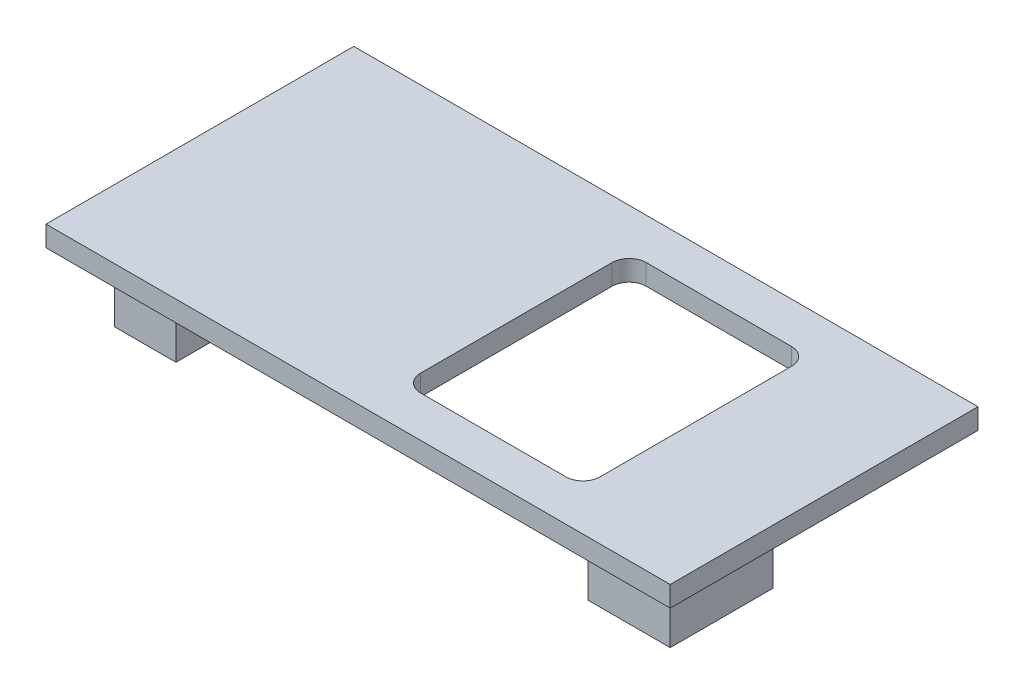
ISO-10303-21;
HEADER;
FILE_DESCRIPTION(('STEP AP214'),'2;1');
FILE_NAME('part.step','',(''),(''),'','','');
FILE_SCHEMA(('AUTOMOTIVE_DESIGN { 1 0 10303 214 1 1 1 1 }'));
ENDSEC;
DATA;
#1=APPLICATION_CONTEXT('core data for automotive mechanical design processes');
#2=APPLICATION_PROTOCOL_DEFINITION('international standard','automotive_design',2000,#1);
#3=PRODUCT_CONTEXT('',#1,'mechanical');
#4=PRODUCT('Part','Part','',(#3));
#5=PRODUCT_RELATED_PRODUCT_CATEGORY('part','',(#4));
#6=PRODUCT_DEFINITION_FORMATION('','',#4);
#7=PRODUCT_DEFINITION_CONTEXT('part definition',#1,'design');
#8=PRODUCT_DEFINITION('design','',#6,#7);
#9=PRODUCT_DEFINITION_SHAPE('','',#8);
#10=(LENGTH_UNIT() NAMED_UNIT(*) SI_UNIT(.MILLI.,.METRE.));
#11=(NAMED_UNIT(*) PLANE_ANGLE_UNIT() SI_UNIT($,.RADIAN.));
#12=(NAMED_UNIT(*) SI_UNIT($,.STERADIAN.) SOLID_ANGLE_UNIT());
#13=UNCERTAINTY_MEASURE_WITH_UNIT(LENGTH_MEASURE(1.E-05),#10,'distance_accuracy_value','');
#14=(GEOMETRIC_REPRESENTATION_CONTEXT(3) GLOBAL_UNCERTAINTY_ASSIGNED_CONTEXT((#13)) GLOBAL_UNIT_ASSIGNED_CONTEXT((#10,
#11,#12)) REPRESENTATION_CONTEXT('',''));
#15=CARTESIAN_POINT('',(0.,0.,0.));
#16=DIRECTION('',(0.,0.,1.));
#17=DIRECTION('',(1.,0.,0.));
#18=AXIS2_PLACEMENT_3D('',#15,#16,#17);
#19=CARTESIAN_POINT('',(0.,0.,0.));
#20=DIRECTION('',(0.,-1.,0.));
#21=DIRECTION('',(0.,0.,-1.));
#22=AXIS2_PLACEMENT_3D('',#19,#20,#21);
#23=PLANE('',#22);
#24=DIRECTION('',(-1.,0.,0.));
#25=VECTOR('',#24,1.);
#26=CARTESIAN_POINT('',(18.5,0.,-15.6));
#27=LINE('',#26,#25);
#28=CARTESIAN_POINT('',(28.,0.,-15.6));
#29=VERTEX_POINT('',#28);
#30=CARTESIAN_POINT('',(19.5,0.,-15.6));
#31=VERTEX_POINT('',#30);
#32=EDGE_CURVE('E377',#29,#31,#27,.T.);
#33=ORIENTED_EDGE('',*,*,#32,.T.);
#34=CARTESIAN_POINT('',(19.5,0.,-14.6));
#35=DIRECTION('',(0.,-1.,0.));
#36=DIRECTION('',(0.,0.,-1.));
#37=AXIS2_PLACEMENT_3D('',#34,#35,#36);
#38=CIRCLE('',#37,1.);
#39=CARTESIAN_POINT('',(18.5,0.,-14.6));
#40=VERTEX_POINT('',#39);
#41=EDGE_CURVE('E11',#31,#40,#38,.F.);
#42=ORIENTED_EDGE('',*,*,#41,.T.);
#43=DIRECTION('',(0.,0.,1.));
#44=VECTOR('',#43,1.);
#45=CARTESIAN_POINT('',(18.5,0.,-15.6));
#46=LINE('',#45,#44);
#47=CARTESIAN_POINT('',(18.5,0.,-3.4));
#48=VERTEX_POINT('',#47);
#49=EDGE_CURVE('E375',#40,#48,#46,.T.);
#50=ORIENTED_EDGE('',*,*,#49,.T.);
#51=CARTESIAN_POINT('',(19.5,0.,-3.4));
#52=DIRECTION('',(0.,-1.,0.));
#53=DIRECTION('',(0.,0.,-1.));
#54=AXIS2_PLACEMENT_3D('',#51,#52,#53);
#55=CIRCLE('',#54,1.);
#56=CARTESIAN_POINT('',(19.5,0.,-2.4));
#57=VERTEX_POINT('',#56);
#58=EDGE_CURVE('E340',#48,#57,#55,.F.);
#59=ORIENTED_EDGE('',*,*,#58,.T.);
#60=DIRECTION('',(1.,0.,0.));
#61=VECTOR('',#60,1.);
#62=CARTESIAN_POINT('',(18.5,0.,-2.4));
#63=LINE('',#62,#61);
#64=CARTESIAN_POINT('',(28.,0.,-2.4));
#65=VERTEX_POINT('',#64);
#66=EDGE_CURVE('E368',#57,#65,#63,.T.);
#67=ORIENTED_EDGE('',*,*,#66,.T.);
#68=CARTESIAN_POINT('',(28.,0.,-3.4));
#69=DIRECTION('',(0.,-1.,0.));
#70=DIRECTION('',(0.,0.,-1.));
#71=AXIS2_PLACEMENT_3D('',#68,#69,#70);
#72=CIRCLE('',#71,1.);
#73=CARTESIAN_POINT('',(29.,0.,-3.4));
#74=VERTEX_POINT('',#73);
#75=EDGE_CURVE('E346',#65,#74,#72,.F.);
#76=ORIENTED_EDGE('',*,*,#75,.T.);
#77=DIRECTION('',(0.,0.,-1.));
#78=VECTOR('',#77,1.);
#79=CARTESIAN_POINT('',(29.,0.,-15.6));
#80=LINE('',#79,#78);
#81=CARTESIAN_POINT('',(29.,0.,-14.6));
#82=VERTEX_POINT('',#81);
#83=EDGE_CURVE('E387',#74,#82,#80,.T.);
#84=ORIENTED_EDGE('',*,*,#83,.T.);
#85=CARTESIAN_POINT('',(28.,0.,-14.6));
#86=DIRECTION('',(0.,-1.,0.));
#87=DIRECTION('',(0.,0.,-1.));
#88=AXIS2_PLACEMENT_3D('',#85,#86,#87);
#89=CIRCLE('',#88,1.);
#90=EDGE_CURVE('E68',#82,#29,#89,.F.);
#91=ORIENTED_EDGE('',*,*,#90,.T.);
#92=EDGE_LOOP('',(#33,#42,#50,#59,#67,#76,#84,#91));
#93=FACE_BOUND('',#92,.T.);
#94=DIRECTION('',(0.,0.,1.));
#95=VECTOR('',#94,1.);
#96=CARTESIAN_POINT('',(0.,0.,0.));
#97=LINE('',#96,#95);
#98=CARTESIAN_POINT('',(0.,0.,-18.));
#99=VERTEX_POINT('',#98);
#100=CARTESIAN_POINT('',(0.,0.,0.));
#101=VERTEX_POINT('',#100);
#102=EDGE_CURVE('E268',#99,#101,#97,.T.);
#103=ORIENTED_EDGE('',*,*,#102,.F.);
#104=DIRECTION('',(-1.,0.,0.));
#105=VECTOR('',#104,1.);
#106=CARTESIAN_POINT('',(0.,0.,-18.));
#107=LINE('',#106,#105);
#108=CARTESIAN_POINT('',(36.5,0.,-18.));
#109=VERTEX_POINT('',#108);
#110=EDGE_CURVE('E274',#109,#99,#107,.T.);
#111=ORIENTED_EDGE('',*,*,#110,.F.);
#112=DIRECTION('',(0.,0.,-1.));
#113=VECTOR('',#112,1.);
#114=CARTESIAN_POINT('',(36.5,0.,0.));
#115=LINE('',#114,#113);
#116=CARTESIAN_POINT('',(36.5,0.,0.));
#117=VERTEX_POINT('',#116);
#118=EDGE_CURVE('E290',#117,#109,#115,.T.);
#119=ORIENTED_EDGE('',*,*,#118,.F.);
#120=DIRECTION('',(1.,0.,0.));
#121=VECTOR('',#120,1.);
#122=CARTESIAN_POINT('',(0.,0.,0.));
#123=LINE('',#122,#121);
#124=EDGE_CURVE('E287',#101,#117,#123,.T.);
#125=ORIENTED_EDGE('',*,*,#124,.F.);
#126=EDGE_LOOP('',(#103,#111,#119,#125));
#127=FACE_BOUND('',#126,.T.);
#128=DIRECTION('',(1.,0.,0.));
#129=VECTOR('',#128,1.);
#130=CARTESIAN_POINT('',(2.,0.,-7.));
#131=LINE('',#130,#129);
#132=CARTESIAN_POINT('',(2.,0.,-7.));
#133=VERTEX_POINT('',#132);
#134=CARTESIAN_POINT('',(5.6,0.,-7.));
#135=VERTEX_POINT('',#134);
#136=EDGE_CURVE('E217',#133,#135,#131,.T.);
#137=ORIENTED_EDGE('',*,*,#136,.F.);
#138=DIRECTION('',(0.,0.,-1.));
#139=VECTOR('',#138,1.);
#140=CARTESIAN_POINT('',(2.,0.,-2.));
#141=LINE('',#140,#139);
#142=CARTESIAN_POINT('',(2.,0.,-2.));
#143=VERTEX_POINT('',#142);
#144=EDGE_CURVE('E212',#143,#133,#141,.T.);
#145=ORIENTED_EDGE('',*,*,#144,.F.);
#146=DIRECTION('',(-1.,0.,0.));
#147=VECTOR('',#146,1.);
#148=CARTESIAN_POINT('',(2.,0.,-2.));
#149=LINE('',#148,#147);
#150=CARTESIAN_POINT('',(5.6,0.,-2.));
#151=VERTEX_POINT('',#150);
#152=EDGE_CURVE('E237',#151,#143,#149,.T.);
#153=ORIENTED_EDGE('',*,*,#152,.F.);
#154=DIRECTION('',(0.,0.,1.));
#155=VECTOR('',#154,1.);
#156=CARTESIAN_POINT('',(5.6,0.,-2.));
#157=LINE('',#156,#155);
#158=EDGE_CURVE('E249',#135,#151,#157,.T.);
#159=ORIENTED_EDGE('',*,*,#158,.F.);
#160=EDGE_LOOP('',(#137,#145,#153,#159));
#161=FACE_BOUND('',#160,.T.);
#162=DIRECTION('',(-1.,0.,0.));
#163=VECTOR('',#162,1.);
#164=CARTESIAN_POINT('',(34.5,0.,-2.));
#165=LINE('',#164,#163);
#166=CARTESIAN_POINT('',(34.5,0.,-2.));
#167=VERTEX_POINT('',#166);
#168=CARTESIAN_POINT('',(29.7,0.,-2.));
#169=VERTEX_POINT('',#168);
#170=EDGE_CURVE('E210',#167,#169,#165,.T.);
#171=ORIENTED_EDGE('',*,*,#170,.F.);
#172=DIRECTION('',(0.,0.,1.));
#173=VECTOR('',#172,1.);
#174=CARTESIAN_POINT('',(34.5,0.,-2.));
#175=LINE('',#174,#173);
#176=CARTESIAN_POINT('',(34.5,0.,-8.));
#177=VERTEX_POINT('',#176);
#178=EDGE_CURVE('E204',#177,#167,#175,.T.);
#179=ORIENTED_EDGE('',*,*,#178,.F.);
#180=DIRECTION('',(1.,0.,0.));
#181=VECTOR('',#180,1.);
#182=CARTESIAN_POINT('',(34.5,0.,-8.));
#183=LINE('',#182,#181);
#184=CARTESIAN_POINT('',(29.7,0.,-8.));
#185=VERTEX_POINT('',#184);
#186=EDGE_CURVE('E184',#185,#177,#183,.T.);
#187=ORIENTED_EDGE('',*,*,#186,.F.);
#188=DIRECTION('',(0.,0.,-1.));
#189=VECTOR('',#188,1.);
#190=CARTESIAN_POINT('',(29.7,0.,-2.));
#191=LINE('',#190,#189);
#192=EDGE_CURVE('E197',#169,#185,#191,.T.);
#193=ORIENTED_EDGE('',*,*,#192,.F.);
#194=EDGE_LOOP('',(#171,#179,#187,#193));
#195=FACE_BOUND('',#194,.T.);
#196=ADVANCED_FACE('F45',(#93,#127,#161,#195),#23,.T.);
#197=CARTESIAN_POINT('',(0.,1.2,0.));
#198=DIRECTION('',(1.,0.,0.));
#199=DIRECTION('',(0.,0.,-1.));
#200=AXIS2_PLACEMENT_3D('',#197,#198,#199);
#201=PLANE('',#200);
#202=ORIENTED_EDGE('',*,*,#102,.T.);
#203=DIRECTION('',(0.,-1.,0.));
#204=VECTOR('',#203,1.);
#205=CARTESIAN_POINT('',(0.,1.2,0.));
#206=LINE('',#205,#204);
#207=CARTESIAN_POINT('',(0.,1.2,0.));
#208=VERTEX_POINT('',#207);
#209=EDGE_CURVE('E306',#208,#101,#206,.T.);
#210=ORIENTED_EDGE('',*,*,#209,.F.);
#211=DIRECTION('',(0.,0.,1.));
#212=VECTOR('',#211,1.);
#213=CARTESIAN_POINT('',(0.,1.2,0.));
#214=LINE('',#213,#212);
#215=CARTESIAN_POINT('',(0.,1.2,-18.));
#216=VERTEX_POINT('',#215);
#217=EDGE_CURVE('E269',#216,#208,#214,.T.);
#218=ORIENTED_EDGE('',*,*,#217,.F.);
#219=DIRECTION('',(0.,-1.,0.));
#220=VECTOR('',#219,1.);
#221=CARTESIAN_POINT('',(0.,1.2,-18.));
#222=LINE('',#221,#220);
#223=EDGE_CURVE('E283',#216,#99,#222,.T.);
#224=ORIENTED_EDGE('',*,*,#223,.T.);
#225=EDGE_LOOP('',(#202,#210,#218,#224));
#226=FACE_BOUND('',#225,.T.);
#227=ADVANCED_FACE('F427',(#226),#201,.F.);
#228=CARTESIAN_POINT('',(0.,1.2,0.));
#229=DIRECTION('',(0.,0.,-1.));
#230=DIRECTION('',(-1.,0.,0.));
#231=AXIS2_PLACEMENT_3D('',#228,#229,#230);
#232=PLANE('',#231);
#233=ORIENTED_EDGE('',*,*,#124,.T.);
#234=DIRECTION('',(0.,-1.,0.));
#235=VECTOR('',#234,1.);
#236=CARTESIAN_POINT('',(36.5,1.2,0.));
#237=LINE('',#236,#235);
#238=CARTESIAN_POINT('',(36.5,1.2,0.));
#239=VERTEX_POINT('',#238);
#240=EDGE_CURVE('E302',#239,#117,#237,.T.);
#241=ORIENTED_EDGE('',*,*,#240,.F.);
#242=DIRECTION('',(1.,0.,0.));
#243=VECTOR('',#242,1.);
#244=CARTESIAN_POINT('',(0.,1.2,0.));
#245=LINE('',#244,#243);
#246=EDGE_CURVE('E273',#208,#239,#245,.T.);
#247=ORIENTED_EDGE('',*,*,#246,.F.);
#248=ORIENTED_EDGE('',*,*,#209,.T.);
#249=EDGE_LOOP('',(#233,#241,#247,#248));
#250=FACE_BOUND('',#249,.T.);
#251=ADVANCED_FACE('F433',(#250),#232,.F.);
#252=CARTESIAN_POINT('',(36.5,1.2,0.));
#253=DIRECTION('',(-1.,0.,0.));
#254=DIRECTION('',(0.,0.,1.));
#255=AXIS2_PLACEMENT_3D('',#252,#253,#254);
#256=PLANE('',#255);
#257=ORIENTED_EDGE('',*,*,#118,.T.);
#258=DIRECTION('',(0.,-1.,0.));
#259=VECTOR('',#258,1.);
#260=CARTESIAN_POINT('',(36.5,1.2,-18.));
#261=LINE('',#260,#259);
#262=CARTESIAN_POINT('',(36.5,1.2,-18.));
#263=VERTEX_POINT('',#262);
#264=EDGE_CURVE('E298',#263,#109,#261,.T.);
#265=ORIENTED_EDGE('',*,*,#264,.F.);
#266=DIRECTION('',(0.,0.,-1.));
#267=VECTOR('',#266,1.);
#268=CARTESIAN_POINT('',(36.5,1.2,0.));
#269=LINE('',#268,#267);
#270=EDGE_CURVE('E277',#239,#263,#269,.T.);
#271=ORIENTED_EDGE('',*,*,#270,.F.);
#272=ORIENTED_EDGE('',*,*,#240,.T.);
#273=EDGE_LOOP('',(#257,#265,#271,#272));
#274=FACE_BOUND('',#273,.T.);
#275=ADVANCED_FACE('F442',(#274),#256,.F.);
#276=CARTESIAN_POINT('',(0.,1.2,-18.));
#277=DIRECTION('',(0.,0.,1.));
#278=DIRECTION('',(1.,0.,0.));
#279=AXIS2_PLACEMENT_3D('',#276,#277,#278);
#280=PLANE('',#279);
#281=ORIENTED_EDGE('',*,*,#110,.T.);
#282=ORIENTED_EDGE('',*,*,#223,.F.);
#283=DIRECTION('',(-1.,0.,0.));
#284=VECTOR('',#283,1.);
#285=CARTESIAN_POINT('',(0.,1.2,-18.));
#286=LINE('',#285,#284);
#287=EDGE_CURVE('E280',#263,#216,#286,.T.);
#288=ORIENTED_EDGE('',*,*,#287,.F.);
#289=ORIENTED_EDGE('',*,*,#264,.T.);
#290=EDGE_LOOP('',(#281,#282,#288,#289));
#291=FACE_BOUND('',#290,.T.);
#292=ADVANCED_FACE('F439',(#291),#280,.F.);
#293=CARTESIAN_POINT('',(0.,1.2,0.));
#294=DIRECTION('',(0.,-1.,0.));
#295=DIRECTION('',(0.,0.,-1.));
#296=AXIS2_PLACEMENT_3D('',#293,#294,#295);
#297=PLANE('',#296);
#298=DIRECTION('',(1.,0.,0.));
#299=VECTOR('',#298,1.);
#300=CARTESIAN_POINT('',(18.5,1.2,-2.4));
#301=LINE('',#300,#299);
#302=CARTESIAN_POINT('',(19.5,1.2,-2.4));
#303=VERTEX_POINT('',#302);
#304=CARTESIAN_POINT('',(28.,1.2,-2.4));
#305=VERTEX_POINT('',#304);
#306=EDGE_CURVE('E385',#303,#305,#301,.T.);
#307=ORIENTED_EDGE('',*,*,#306,.F.);
#308=CARTESIAN_POINT('',(19.5,1.2,-3.4));
#309=DIRECTION('',(0.,-1.,0.));
#310=DIRECTION('',(0.,0.,-1.));
#311=AXIS2_PLACEMENT_3D('',#308,#309,#310);
#312=CIRCLE('',#311,1.);
#313=CARTESIAN_POINT('',(18.5,1.2,-3.4));
#314=VERTEX_POINT('',#313);
#315=EDGE_CURVE('E337',#303,#314,#312,.T.);
#316=ORIENTED_EDGE('',*,*,#315,.T.);
#317=DIRECTION('',(0.,0.,1.));
#318=VECTOR('',#317,1.);
#319=CARTESIAN_POINT('',(18.5,1.2,-15.6));
#320=LINE('',#319,#318);
#321=CARTESIAN_POINT('',(18.5,1.2,-14.6));
#322=VERTEX_POINT('',#321);
#323=EDGE_CURVE('E362',#322,#314,#320,.T.);
#324=ORIENTED_EDGE('',*,*,#323,.F.);
#325=CARTESIAN_POINT('',(19.5,1.2,-14.6));
#326=DIRECTION('',(0.,-1.,0.));
#327=DIRECTION('',(0.,0.,-1.));
#328=AXIS2_PLACEMENT_3D('',#325,#326,#327);
#329=CIRCLE('',#328,1.);
#330=CARTESIAN_POINT('',(19.5,1.2,-15.6));
#331=VERTEX_POINT('',#330);
#332=EDGE_CURVE('E54',#322,#331,#329,.T.);
#333=ORIENTED_EDGE('',*,*,#332,.T.);
#334=DIRECTION('',(-1.,0.,0.));
#335=VECTOR('',#334,1.);
#336=CARTESIAN_POINT('',(18.5,1.2,-15.6));
#337=LINE('',#336,#335);
#338=CARTESIAN_POINT('',(28.,1.2,-15.6));
#339=VERTEX_POINT('',#338);
#340=EDGE_CURVE('E360',#339,#331,#337,.T.);
#341=ORIENTED_EDGE('',*,*,#340,.F.);
#342=CARTESIAN_POINT('',(28.,1.2,-14.6));
#343=DIRECTION('',(0.,-1.,0.));
#344=DIRECTION('',(0.,0.,-1.));
#345=AXIS2_PLACEMENT_3D('',#342,#343,#344);
#346=CIRCLE('',#345,1.);
#347=CARTESIAN_POINT('',(29.,1.2,-14.6));
#348=VERTEX_POINT('',#347);
#349=EDGE_CURVE('E349',#339,#348,#346,.T.);
#350=ORIENTED_EDGE('',*,*,#349,.T.);
#351=DIRECTION('',(0.,0.,-1.));
#352=VECTOR('',#351,1.);
#353=CARTESIAN_POINT('',(29.,1.2,-15.6));
#354=LINE('',#353,#352);
#355=CARTESIAN_POINT('',(29.,1.2,-3.4));
#356=VERTEX_POINT('',#355);
#357=EDGE_CURVE('E369',#356,#348,#354,.T.);
#358=ORIENTED_EDGE('',*,*,#357,.F.);
#359=CARTESIAN_POINT('',(28.,1.2,-3.4));
#360=DIRECTION('',(0.,-1.,0.));
#361=DIRECTION('',(0.,0.,-1.));
#362=AXIS2_PLACEMENT_3D('',#359,#360,#361);
#363=CIRCLE('',#362,1.);
#364=EDGE_CURVE('E343',#356,#305,#363,.T.);
#365=ORIENTED_EDGE('',*,*,#364,.T.);
#366=EDGE_LOOP('',(#307,#316,#324,#333,#341,#350,#358,#365));
#367=FACE_BOUND('',#366,.T.);
#368=ORIENTED_EDGE('',*,*,#217,.T.);
#369=ORIENTED_EDGE('',*,*,#246,.T.);
#370=ORIENTED_EDGE('',*,*,#270,.T.);
#371=ORIENTED_EDGE('',*,*,#287,.T.);
#372=EDGE_LOOP('',(#368,#369,#370,#371));
#373=FACE_BOUND('',#372,.T.);
#374=ADVANCED_FACE('F358',(#367,#373),#297,.F.);
#375=CARTESIAN_POINT('',(2.,-4.,-2.));
#376=DIRECTION('',(1.,0.,0.));
#377=DIRECTION('',(0.,0.,-1.));
#378=AXIS2_PLACEMENT_3D('',#375,#376,#377);
#379=PLANE('',#378);
#380=ORIENTED_EDGE('',*,*,#144,.T.);
#381=DIRECTION('',(0.,1.,0.));
#382=VECTOR('',#381,1.);
#383=CARTESIAN_POINT('',(2.,-4.,-7.));
#384=LINE('',#383,#382);
#385=CARTESIAN_POINT('',(2.,-4.,-7.));
#386=VERTEX_POINT('',#385);
#387=EDGE_CURVE('E265',#386,#133,#384,.T.);
#388=ORIENTED_EDGE('',*,*,#387,.F.);
#389=DIRECTION('',(0.,0.,-1.));
#390=VECTOR('',#389,1.);
#391=CARTESIAN_POINT('',(2.,-4.,-2.));
#392=LINE('',#391,#390);
#393=CARTESIAN_POINT('',(2.,-4.,-2.));
#394=VERTEX_POINT('',#393);
#395=EDGE_CURVE('E232',#394,#386,#392,.T.);
#396=ORIENTED_EDGE('',*,*,#395,.F.);
#397=DIRECTION('',(0.,1.,0.));
#398=VECTOR('',#397,1.);
#399=CARTESIAN_POINT('',(2.,-4.,-2.));
#400=LINE('',#399,#398);
#401=EDGE_CURVE('E245',#394,#143,#400,.T.);
#402=ORIENTED_EDGE('',*,*,#401,.T.);
#403=EDGE_LOOP('',(#380,#388,#396,#402));
#404=FACE_BOUND('',#403,.T.);
#405=ADVANCED_FACE('F554',(#404),#379,.F.);
#406=CARTESIAN_POINT('',(2.,-4.,-7.));
#407=DIRECTION('',(0.,0.,1.));
#408=DIRECTION('',(1.,0.,0.));
#409=AXIS2_PLACEMENT_3D('',#406,#407,#408);
#410=PLANE('',#409);
#411=ORIENTED_EDGE('',*,*,#136,.T.);
#412=DIRECTION('',(0.,1.,0.));
#413=VECTOR('',#412,1.);
#414=CARTESIAN_POINT('',(5.6,-4.,-7.));
#415=LINE('',#414,#413);
#416=CARTESIAN_POINT('',(5.6,-4.,-7.));
#417=VERTEX_POINT('',#416);
#418=EDGE_CURVE('E261',#417,#135,#415,.T.);
#419=ORIENTED_EDGE('',*,*,#418,.F.);
#420=DIRECTION('',(1.,0.,0.));
#421=VECTOR('',#420,1.);
#422=CARTESIAN_POINT('',(2.,-4.,-7.));
#423=LINE('',#422,#421);
#424=EDGE_CURVE('E236',#386,#417,#423,.T.);
#425=ORIENTED_EDGE('',*,*,#424,.F.);
#426=ORIENTED_EDGE('',*,*,#387,.T.);
#427=EDGE_LOOP('',(#411,#419,#425,#426));
#428=FACE_BOUND('',#427,.T.);
#429=ADVANCED_FACE('F574',(#428),#410,.F.);
#430=CARTESIAN_POINT('',(5.6,-4.,-2.));
#431=DIRECTION('',(-1.,0.,0.));
#432=DIRECTION('',(0.,0.,1.));
#433=AXIS2_PLACEMENT_3D('',#430,#431,#432);
#434=PLANE('',#433);
#435=ORIENTED_EDGE('',*,*,#158,.T.);
#436=DIRECTION('',(0.,1.,0.));
#437=VECTOR('',#436,1.);
#438=CARTESIAN_POINT('',(5.6,-4.,-2.));
#439=LINE('',#438,#437);
#440=CARTESIAN_POINT('',(5.6,-4.,-2.));
#441=VERTEX_POINT('',#440);
#442=EDGE_CURVE('E258',#441,#151,#439,.T.);
#443=ORIENTED_EDGE('',*,*,#442,.F.);
#444=DIRECTION('',(0.,0.,1.));
#445=VECTOR('',#444,1.);
#446=CARTESIAN_POINT('',(5.6,-4.,-2.));
#447=LINE('',#446,#445);
#448=EDGE_CURVE('E240',#417,#441,#447,.T.);
#449=ORIENTED_EDGE('',*,*,#448,.F.);
#450=ORIENTED_EDGE('',*,*,#418,.T.);
#451=EDGE_LOOP('',(#435,#443,#449,#450));
#452=FACE_BOUND('',#451,.T.);
#453=ADVANCED_FACE('F583',(#452),#434,.F.);
#454=CARTESIAN_POINT('',(2.,-4.,-2.));
#455=DIRECTION('',(0.,0.,-1.));
#456=DIRECTION('',(-1.,0.,0.));
#457=AXIS2_PLACEMENT_3D('',#454,#455,#456);
#458=PLANE('',#457);
#459=ORIENTED_EDGE('',*,*,#152,.T.);
#460=ORIENTED_EDGE('',*,*,#401,.F.);
#461=DIRECTION('',(-1.,0.,0.));
#462=VECTOR('',#461,1.);
#463=CARTESIAN_POINT('',(2.,-4.,-2.));
#464=LINE('',#463,#462);
#465=EDGE_CURVE('E243',#441,#394,#464,.T.);
#466=ORIENTED_EDGE('',*,*,#465,.F.);
#467=ORIENTED_EDGE('',*,*,#442,.T.);
#468=EDGE_LOOP('',(#459,#460,#466,#467));
#469=FACE_BOUND('',#468,.T.);
#470=ADVANCED_FACE('F593',(#469),#458,.F.);
#471=CARTESIAN_POINT('',(0.,-4.,0.));
#472=DIRECTION('',(0.,-1.,0.));
#473=DIRECTION('',(0.,0.,-1.));
#474=AXIS2_PLACEMENT_3D('',#471,#472,#473);
#475=PLANE('',#474);
#476=ORIENTED_EDGE('',*,*,#395,.T.);
#477=ORIENTED_EDGE('',*,*,#424,.T.);
#478=ORIENTED_EDGE('',*,*,#448,.T.);
#479=ORIENTED_EDGE('',*,*,#465,.T.);
#480=EDGE_LOOP('',(#476,#477,#478,#479));
#481=FACE_BOUND('',#480,.T.);
#482=ADVANCED_FACE('F486',(#481),#475,.T.);
#483=CARTESIAN_POINT('',(34.5,-4.,-2.));
#484=DIRECTION('',(-1.,0.,0.));
#485=DIRECTION('',(0.,0.,1.));
#486=AXIS2_PLACEMENT_3D('',#483,#484,#485);
#487=PLANE('',#486);
#488=ORIENTED_EDGE('',*,*,#178,.T.);
#489=DIRECTION('',(0.,1.,0.));
#490=VECTOR('',#489,1.);
#491=CARTESIAN_POINT('',(34.5,-4.,-2.));
#492=LINE('',#491,#490);
#493=CARTESIAN_POINT('',(34.5,-4.,-2.));
#494=VERTEX_POINT('',#493);
#495=EDGE_CURVE('E400',#494,#167,#492,.T.);
#496=ORIENTED_EDGE('',*,*,#495,.F.);
#497=DIRECTION('',(0.,0.,1.));
#498=VECTOR('',#497,1.);
#499=CARTESIAN_POINT('',(34.5,-4.,-2.));
#500=LINE('',#499,#498);
#501=CARTESIAN_POINT('',(34.5,-4.,-8.));
#502=VERTEX_POINT('',#501);
#503=EDGE_CURVE('E198',#502,#494,#500,.T.);
#504=ORIENTED_EDGE('',*,*,#503,.F.);
#505=DIRECTION('',(0.,1.,0.));
#506=VECTOR('',#505,1.);
#507=CARTESIAN_POINT('',(34.5,-4.,-8.));
#508=LINE('',#507,#506);
#509=EDGE_CURVE('E188',#502,#177,#508,.T.);
#510=ORIENTED_EDGE('',*,*,#509,.T.);
#511=EDGE_LOOP('',(#488,#496,#504,#510));
#512=FACE_BOUND('',#511,.T.);
#513=ADVANCED_FACE('F202',(#512),#487,.F.);
#514=CARTESIAN_POINT('',(34.5,-4.,-2.));
#515=DIRECTION('',(0.,0.,-1.));
#516=DIRECTION('',(-1.,0.,0.));
#517=AXIS2_PLACEMENT_3D('',#514,#515,#516);
#518=PLANE('',#517);
#519=ORIENTED_EDGE('',*,*,#170,.T.);
#520=DIRECTION('',(0.,1.,0.));
#521=VECTOR('',#520,1.);
#522=CARTESIAN_POINT('',(29.7,-4.,-2.));
#523=LINE('',#522,#521);
#524=CARTESIAN_POINT('',(29.7,-4.,-2.));
#525=VERTEX_POINT('',#524);
#526=EDGE_CURVE('E403',#525,#169,#523,.T.);
#527=ORIENTED_EDGE('',*,*,#526,.F.);
#528=DIRECTION('',(-1.,0.,0.));
#529=VECTOR('',#528,1.);
#530=CARTESIAN_POINT('',(34.5,-4.,-2.));
#531=LINE('',#530,#529);
#532=EDGE_CURVE('E227',#494,#525,#531,.T.);
#533=ORIENTED_EDGE('',*,*,#532,.F.);
#534=ORIENTED_EDGE('',*,*,#495,.T.);
#535=EDGE_LOOP('',(#519,#527,#533,#534));
#536=FACE_BOUND('',#535,.T.);
#537=ADVANCED_FACE('F414',(#536),#518,.F.);
#538=CARTESIAN_POINT('',(29.7,-4.,-2.));
#539=DIRECTION('',(1.,0.,0.));
#540=DIRECTION('',(0.,0.,-1.));
#541=AXIS2_PLACEMENT_3D('',#538,#539,#540);
#542=PLANE('',#541);
#543=ORIENTED_EDGE('',*,*,#192,.T.);
#544=DIRECTION('',(0.,1.,0.));
#545=VECTOR('',#544,1.);
#546=CARTESIAN_POINT('',(29.7,-4.,-8.));
#547=LINE('',#546,#545);
#548=CARTESIAN_POINT('',(29.7,-4.,-8.));
#549=VERTEX_POINT('',#548);
#550=EDGE_CURVE('E191',#549,#185,#547,.T.);
#551=ORIENTED_EDGE('',*,*,#550,.F.);
#552=DIRECTION('',(0.,0.,-1.));
#553=VECTOR('',#552,1.);
#554=CARTESIAN_POINT('',(29.7,-4.,-2.));
#555=LINE('',#554,#553);
#556=EDGE_CURVE('E224',#525,#549,#555,.T.);
#557=ORIENTED_EDGE('',*,*,#556,.F.);
#558=ORIENTED_EDGE('',*,*,#526,.T.);
#559=EDGE_LOOP('',(#543,#551,#557,#558));
#560=FACE_BOUND('',#559,.T.);
#561=ADVANCED_FACE('F410',(#560),#542,.F.);
#562=CARTESIAN_POINT('',(34.5,-4.,-8.));
#563=DIRECTION('',(0.,0.,1.));
#564=DIRECTION('',(1.,0.,0.));
#565=AXIS2_PLACEMENT_3D('',#562,#563,#564);
#566=PLANE('',#565);
#567=ORIENTED_EDGE('',*,*,#186,.T.);
#568=ORIENTED_EDGE('',*,*,#509,.F.);
#569=DIRECTION('',(1.,0.,0.));
#570=VECTOR('',#569,1.);
#571=CARTESIAN_POINT('',(34.5,-4.,-8.));
#572=LINE('',#571,#570);
#573=EDGE_CURVE('E208',#549,#502,#572,.T.);
#574=ORIENTED_EDGE('',*,*,#573,.F.);
#575=ORIENTED_EDGE('',*,*,#550,.T.);
#576=EDGE_LOOP('',(#567,#568,#574,#575));
#577=FACE_BOUND('',#576,.T.);
#578=ADVANCED_FACE('F186',(#577),#566,.F.);
#579=CARTESIAN_POINT('',(0.,-4.,0.));
#580=DIRECTION('',(0.,1.,0.));
#581=DIRECTION('',(0.,0.,1.));
#582=AXIS2_PLACEMENT_3D('',#579,#580,#581);
#583=PLANE('',#582);
#584=ORIENTED_EDGE('',*,*,#503,.T.);
#585=ORIENTED_EDGE('',*,*,#532,.T.);
#586=ORIENTED_EDGE('',*,*,#556,.T.);
#587=ORIENTED_EDGE('',*,*,#573,.T.);
#588=EDGE_LOOP('',(#584,#585,#586,#587));
#589=FACE_BOUND('',#588,.T.);
#590=ADVANCED_FACE('F416',(#589),#583,.F.);
#591=CARTESIAN_POINT('',(18.5,-4.001,-15.6));
#592=DIRECTION('',(-1.,0.,0.));
#593=DIRECTION('',(0.,0.,1.));
#594=AXIS2_PLACEMENT_3D('',#591,#592,#593);
#595=PLANE('',#594);
#596=ORIENTED_EDGE('',*,*,#323,.T.);
#597=DIRECTION('',(0.,1.,0.));
#598=VECTOR('',#597,1.);
#599=CARTESIAN_POINT('',(18.5,0.,-3.4));
#600=LINE('',#599,#598);
#601=EDGE_CURVE('E321',#314,#48,#600,.F.);
#602=ORIENTED_EDGE('',*,*,#601,.T.);
#603=ORIENTED_EDGE('',*,*,#49,.F.);
#604=DIRECTION('',(0.,1.,0.));
#605=VECTOR('',#604,1.);
#606=CARTESIAN_POINT('',(18.5,1.2,-14.6));
#607=LINE('',#606,#605);
#608=EDGE_CURVE('E317',#40,#322,#607,.T.);
#609=ORIENTED_EDGE('',*,*,#608,.T.);
#610=EDGE_LOOP('',(#596,#602,#603,#609));
#611=FACE_BOUND('',#610,.T.);
#612=ADVANCED_FACE('F379',(#611),#595,.F.);
#613=CARTESIAN_POINT('',(18.5,-4.001,-15.6));
#614=DIRECTION('',(0.,0.,-1.));
#615=DIRECTION('',(-1.,0.,0.));
#616=AXIS2_PLACEMENT_3D('',#613,#614,#615);
#617=PLANE('',#616);
#618=ORIENTED_EDGE('',*,*,#32,.F.);
#619=DIRECTION('',(0.,1.,0.));
#620=VECTOR('',#619,1.);
#621=CARTESIAN_POINT('',(28.,1.2,-15.6));
#622=LINE('',#621,#620);
#623=EDGE_CURVE('E333',#29,#339,#622,.T.);
#624=ORIENTED_EDGE('',*,*,#623,.T.);
#625=ORIENTED_EDGE('',*,*,#340,.T.);
#626=DIRECTION('',(0.,1.,0.));
#627=VECTOR('',#626,1.);
#628=CARTESIAN_POINT('',(19.5,0.,-15.6));
#629=LINE('',#628,#627);
#630=EDGE_CURVE('E61',#331,#31,#629,.F.);
#631=ORIENTED_EDGE('',*,*,#630,.T.);
#632=EDGE_LOOP('',(#618,#624,#625,#631));
#633=FACE_BOUND('',#632,.T.);
#634=ADVANCED_FACE('F365',(#633),#617,.F.);
#635=CARTESIAN_POINT('',(29.,-4.001,-15.6));
#636=DIRECTION('',(1.,0.,0.));
#637=DIRECTION('',(0.,0.,-1.));
#638=AXIS2_PLACEMENT_3D('',#635,#636,#637);
#639=PLANE('',#638);
#640=ORIENTED_EDGE('',*,*,#83,.F.);
#641=DIRECTION('',(0.,1.,0.));
#642=VECTOR('',#641,1.);
#643=CARTESIAN_POINT('',(29.,1.2,-3.4));
#644=LINE('',#643,#642);
#645=EDGE_CURVE('E327',#74,#356,#644,.T.);
#646=ORIENTED_EDGE('',*,*,#645,.T.);
#647=ORIENTED_EDGE('',*,*,#357,.T.);
#648=DIRECTION('',(0.,1.,0.));
#649=VECTOR('',#648,1.);
#650=CARTESIAN_POINT('',(29.,0.,-14.6));
#651=LINE('',#650,#649);
#652=EDGE_CURVE('E324',#348,#82,#651,.F.);
#653=ORIENTED_EDGE('',*,*,#652,.T.);
#654=EDGE_LOOP('',(#640,#646,#647,#653));
#655=FACE_BOUND('',#654,.T.);
#656=ADVANCED_FACE('F468',(#655),#639,.F.);
#657=CARTESIAN_POINT('',(18.5,-4.001,-2.4));
#658=DIRECTION('',(0.,0.,1.));
#659=DIRECTION('',(1.,0.,0.));
#660=AXIS2_PLACEMENT_3D('',#657,#658,#659);
#661=PLANE('',#660);
#662=ORIENTED_EDGE('',*,*,#66,.F.);
#663=DIRECTION('',(0.,1.,0.));
#664=VECTOR('',#663,1.);
#665=CARTESIAN_POINT('',(19.5,1.2,-2.4));
#666=LINE('',#665,#664);
#667=EDGE_CURVE('E313',#57,#303,#666,.T.);
#668=ORIENTED_EDGE('',*,*,#667,.T.);
#669=ORIENTED_EDGE('',*,*,#306,.T.);
#670=DIRECTION('',(0.,1.,0.));
#671=VECTOR('',#670,1.);
#672=CARTESIAN_POINT('',(28.,0.,-2.4));
#673=LINE('',#672,#671);
#674=EDGE_CURVE('E310',#305,#65,#673,.F.);
#675=ORIENTED_EDGE('',*,*,#674,.T.);
#676=EDGE_LOOP('',(#662,#668,#669,#675));
#677=FACE_BOUND('',#676,.T.);
#678=ADVANCED_FACE('F454',(#677),#661,.F.);
#679=CARTESIAN_POINT('',(19.5,-4.001,-3.4));
#680=DIRECTION('',(0.,-1.,0.));
#681=DIRECTION('',(0.,0.,-1.));
#682=AXIS2_PLACEMENT_3D('',#679,#680,#681);
#683=CYLINDRICAL_SURFACE('',#682,1.);
#684=ORIENTED_EDGE('',*,*,#58,.F.);
#685=ORIENTED_EDGE('',*,*,#601,.F.);
#686=ORIENTED_EDGE('',*,*,#315,.F.);
#687=ORIENTED_EDGE('',*,*,#667,.F.);
#688=EDGE_LOOP('',(#684,#685,#686,#687));
#689=FACE_BOUND('',#688,.T.);
#690=ADVANCED_FACE('F450',(#689),#683,.F.);
#691=CARTESIAN_POINT('',(28.,-4.001,-3.4));
#692=DIRECTION('',(0.,-1.,0.));
#693=DIRECTION('',(0.,0.,-1.));
#694=AXIS2_PLACEMENT_3D('',#691,#692,#693);
#695=CYLINDRICAL_SURFACE('',#694,1.);
#696=ORIENTED_EDGE('',*,*,#75,.F.);
#697=ORIENTED_EDGE('',*,*,#674,.F.);
#698=ORIENTED_EDGE('',*,*,#364,.F.);
#699=ORIENTED_EDGE('',*,*,#645,.F.);
#700=EDGE_LOOP('',(#696,#697,#698,#699));
#701=FACE_BOUND('',#700,.T.);
#702=ADVANCED_FACE('F453',(#701),#695,.F.);
#703=CARTESIAN_POINT('',(28.,-4.001,-14.6));
#704=DIRECTION('',(0.,-1.,0.));
#705=DIRECTION('',(0.,0.,-1.));
#706=AXIS2_PLACEMENT_3D('',#703,#704,#705);
#707=CYLINDRICAL_SURFACE('',#706,1.);
#708=ORIENTED_EDGE('',*,*,#90,.F.);
#709=ORIENTED_EDGE('',*,*,#652,.F.);
#710=ORIENTED_EDGE('',*,*,#349,.F.);
#711=ORIENTED_EDGE('',*,*,#623,.F.);
#712=EDGE_LOOP('',(#708,#709,#710,#711));
#713=FACE_BOUND('',#712,.T.);
#714=ADVANCED_FACE('F457',(#713),#707,.F.);
#715=CARTESIAN_POINT('',(19.5,-4.001,-14.6));
#716=DIRECTION('',(0.,-1.,0.));
#717=DIRECTION('',(0.,0.,-1.));
#718=AXIS2_PLACEMENT_3D('',#715,#716,#717);
#719=CYLINDRICAL_SURFACE('',#718,1.);
#720=ORIENTED_EDGE('',*,*,#41,.F.);
#721=ORIENTED_EDGE('',*,*,#630,.F.);
#722=ORIENTED_EDGE('',*,*,#332,.F.);
#723=ORIENTED_EDGE('',*,*,#608,.F.);
#724=EDGE_LOOP('',(#720,#721,#722,#723));
#725=FACE_BOUND('',#724,.T.);
#726=ADVANCED_FACE('F47',(#725),#719,.F.);
#727=CLOSED_SHELL('',(#196,#227,#251,#275,#292,#374,#405,#429,#453,#470,#482,#513,#537,#561,
#578,#590,#612,#634,#656,#678,#690,#702,#714,#726));
#728=MANIFOLD_SOLID_BREP('B2',#727);
#729=ADVANCED_BREP_SHAPE_REPRESENTATION('',(#18,#728),#14);
#730=SHAPE_DEFINITION_REPRESENTATION(#9,#729);
ENDSEC;
END-ISO-10303-21;
